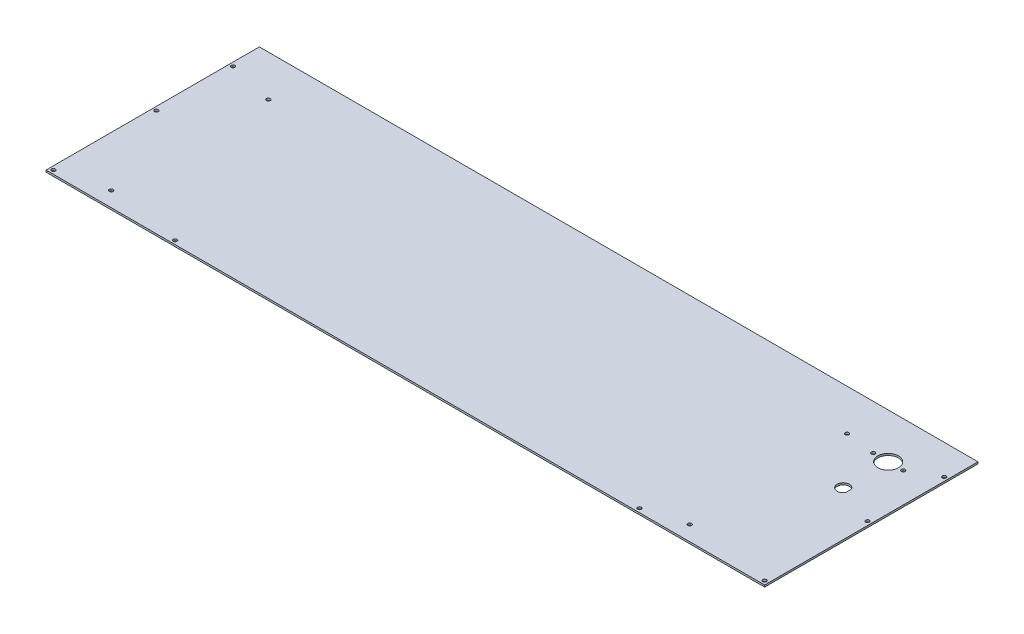
ISO-10303-21;
HEADER;
FILE_DESCRIPTION(('STEP AP214'),'2;1');
FILE_NAME('part.step','',(''),(''),'','','');
FILE_SCHEMA(('AUTOMOTIVE_DESIGN { 1 0 10303 214 1 1 1 1 }'));
ENDSEC;
DATA;
#1=APPLICATION_CONTEXT('core data for automotive mechanical design processes');
#2=APPLICATION_PROTOCOL_DEFINITION('international standard','automotive_design',2000,#1);
#3=PRODUCT_CONTEXT('',#1,'mechanical');
#4=PRODUCT('Part','Part','',(#3));
#5=PRODUCT_RELATED_PRODUCT_CATEGORY('part','',(#4));
#6=PRODUCT_DEFINITION_FORMATION('','',#4);
#7=PRODUCT_DEFINITION_CONTEXT('part definition',#1,'design');
#8=PRODUCT_DEFINITION('design','',#6,#7);
#9=PRODUCT_DEFINITION_SHAPE('','',#8);
#10=(LENGTH_UNIT() NAMED_UNIT(*) SI_UNIT(.MILLI.,.METRE.));
#11=(NAMED_UNIT(*) PLANE_ANGLE_UNIT() SI_UNIT($,.RADIAN.));
#12=(NAMED_UNIT(*) SI_UNIT($,.STERADIAN.) SOLID_ANGLE_UNIT());
#13=UNCERTAINTY_MEASURE_WITH_UNIT(LENGTH_MEASURE(1.E-05),#10,'distance_accuracy_value','');
#14=(GEOMETRIC_REPRESENTATION_CONTEXT(3) GLOBAL_UNCERTAINTY_ASSIGNED_CONTEXT((#13)) GLOBAL_UNIT_ASSIGNED_CONTEXT((#10,
#11,#12)) REPRESENTATION_CONTEXT('',''));
#15=CARTESIAN_POINT('',(0.,0.,0.));
#16=DIRECTION('',(0.,0.,1.));
#17=DIRECTION('',(1.,0.,0.));
#18=AXIS2_PLACEMENT_3D('',#15,#16,#17);
#19=CARTESIAN_POINT('',(-608.0125,358.775,1631.95));
#20=DIRECTION('',(0.,1.,0.));
#21=DIRECTION('',(-1.,0.,0.));
#22=AXIS2_PLACEMENT_3D('',#19,#20,#21);
#23=PLANE('',#22);
#24=CARTESIAN_POINT('',(-152.4,358.775,1787.525));
#25=DIRECTION('',(0.,-1.,0.));
#26=DIRECTION('',(1.,0.,0.));
#27=AXIS2_PLACEMENT_3D('',#24,#25,#26);
#28=CIRCLE('',#27,3.175);
#29=CARTESIAN_POINT('',(-149.225,358.775,1787.525));
#30=VERTEX_POINT('',#29);
#31=EDGE_CURVE('E143',#30,#30,#28,.T.);
#32=ORIENTED_EDGE('',*,*,#31,.T.);
#33=EDGE_LOOP('',(#32));
#34=FACE_BOUND('',#33,.T.);
#35=CARTESIAN_POINT('',(-1212.85,358.775,1806.575));
#36=DIRECTION('',(0.,-1.,0.));
#37=DIRECTION('',(1.,0.,0.));
#38=AXIS2_PLACEMENT_3D('',#35,#36,#37);
#39=CIRCLE('',#38,3.175);
#40=CARTESIAN_POINT('',(-1209.675,358.775,1806.575));
#41=VERTEX_POINT('',#40);
#42=EDGE_CURVE('E182',#41,#41,#39,.T.);
#43=ORIENTED_EDGE('',*,*,#42,.T.);
#44=EDGE_LOOP('',(#43));
#45=FACE_BOUND('',#44,.T.);
#46=CARTESIAN_POINT('',(-1006.475,358.775,1806.575));
#47=DIRECTION('',(0.,-1.,0.));
#48=DIRECTION('',(1.,0.,0.));
#49=AXIS2_PLACEMENT_3D('',#46,#47,#48);
#50=CIRCLE('',#49,3.175);
#51=CARTESIAN_POINT('',(-1003.3,358.775,1806.575));
#52=VERTEX_POINT('',#51);
#53=EDGE_CURVE('E177',#52,#52,#50,.T.);
#54=ORIENTED_EDGE('',*,*,#53,.T.);
#55=EDGE_LOOP('',(#54));
#56=FACE_BOUND('',#55,.T.);
#57=CARTESIAN_POINT('',(-219.075,358.775,1806.575));
#58=DIRECTION('',(0.,-1.,0.));
#59=DIRECTION('',(1.,0.,0.));
#60=AXIS2_PLACEMENT_3D('',#57,#58,#59);
#61=CIRCLE('',#60,3.175);
#62=CARTESIAN_POINT('',(-215.9,358.775,1806.575));
#63=VERTEX_POINT('',#62);
#64=EDGE_CURVE('E168',#63,#63,#61,.T.);
#65=ORIENTED_EDGE('',*,*,#64,.T.);
#66=EDGE_LOOP('',(#65));
#67=FACE_BOUND('',#66,.T.);
#68=DIRECTION('',(0.,0.,1.));
#69=VECTOR('',#68,1.);
#70=CARTESIAN_POINT('',(-4.43505971811969E-13,358.775,1631.95));
#71=LINE('',#70,#69);
#72=CARTESIAN_POINT('',(-4.43943400340539E-13,358.775,1812.925));
#73=VERTEX_POINT('',#72);
#74=CARTESIAN_POINT('',(-4.43797590831016E-13,358.775,1450.975));
#75=VERTEX_POINT('',#74);
#76=EDGE_CURVE('E72',#73,#75,#71,.F.);
#77=ORIENTED_EDGE('',*,*,#76,.T.);
#78=DIRECTION('',(1.,0.,0.));
#79=VECTOR('',#78,1.);
#80=CARTESIAN_POINT('',(-456.940621137619,358.775,1450.975));
#81=LINE('',#80,#79);
#82=CARTESIAN_POINT('',(-1219.2,358.775,1450.975));
#83=VERTEX_POINT('',#82);
#84=EDGE_CURVE('E469',#75,#83,#81,.F.);
#85=ORIENTED_EDGE('',*,*,#84,.T.);
#86=DIRECTION('',(0.,0.,1.));
#87=VECTOR('',#86,1.);
#88=CARTESIAN_POINT('',(-1219.2,358.775,1631.95));
#89=LINE('',#88,#87);
#90=CARTESIAN_POINT('',(-1219.2,358.775,1812.925));
#91=VERTEX_POINT('',#90);
#92=EDGE_CURVE('E75',#83,#91,#89,.T.);
#93=ORIENTED_EDGE('',*,*,#92,.T.);
#94=DIRECTION('',(-1.,0.,0.));
#95=VECTOR('',#94,1.);
#96=CARTESIAN_POINT('',(-609.6,358.775,1812.925));
#97=LINE('',#96,#95);
#98=EDGE_CURVE('E59',#91,#73,#97,.F.);
#99=ORIENTED_EDGE('',*,*,#98,.T.);
#100=EDGE_LOOP('',(#77,#85,#93,#99));
#101=FACE_BOUND('',#100,.T.);
#102=CARTESIAN_POINT('',(-6.35000000000045,358.775,1806.575));
#103=DIRECTION('',(0.,-1.,0.));
#104=DIRECTION('',(1.,0.,0.));
#105=AXIS2_PLACEMENT_3D('',#102,#103,#104);
#106=CIRCLE('',#105,3.175);
#107=CARTESIAN_POINT('',(-3.17500000000045,358.775,1806.575));
#108=VERTEX_POINT('',#107);
#109=EDGE_CURVE('E171',#108,#108,#106,.T.);
#110=ORIENTED_EDGE('',*,*,#109,.T.);
#111=EDGE_LOOP('',(#110));
#112=FACE_BOUND('',#111,.T.);
#113=CARTESIAN_POINT('',(-1212.85,358.775,1501.83991037368));
#114=DIRECTION('',(0.,-1.,0.));
#115=DIRECTION('',(1.,0.,0.));
#116=AXIS2_PLACEMENT_3D('',#113,#114,#115);
#117=CIRCLE('',#116,3.175);
#118=CARTESIAN_POINT('',(-1209.675,358.775,1501.83991037368));
#119=VERTEX_POINT('',#118);
#120=EDGE_CURVE('E77',#119,#119,#117,.T.);
#121=ORIENTED_EDGE('',*,*,#120,.T.);
#122=EDGE_LOOP('',(#121));
#123=FACE_BOUND('',#122,.T.);
#124=CARTESIAN_POINT('',(-1212.85,358.775,1631.95));
#125=DIRECTION('',(0.,-1.,0.));
#126=DIRECTION('',(1.,0.,0.));
#127=AXIS2_PLACEMENT_3D('',#124,#125,#126);
#128=CIRCLE('',#127,3.175);
#129=CARTESIAN_POINT('',(-1209.675,358.775,1631.95));
#130=VERTEX_POINT('',#129);
#131=EDGE_CURVE('E180',#130,#130,#128,.T.);
#132=ORIENTED_EDGE('',*,*,#131,.T.);
#133=EDGE_LOOP('',(#132));
#134=FACE_BOUND('',#133,.T.);
#135=CARTESIAN_POINT('',(-6.35000000000045,358.775,1501.83991037368));
#136=DIRECTION('',(0.,-1.,0.));
#137=DIRECTION('',(1.,0.,0.));
#138=AXIS2_PLACEMENT_3D('',#135,#136,#137);
#139=CIRCLE('',#138,3.175);
#140=CARTESIAN_POINT('',(-3.17500000000045,358.775,1501.83991037368));
#141=VERTEX_POINT('',#140);
#142=EDGE_CURVE('E165',#141,#141,#139,.T.);
#143=ORIENTED_EDGE('',*,*,#142,.T.);
#144=EDGE_LOOP('',(#143));
#145=FACE_BOUND('',#144,.T.);
#146=CARTESIAN_POINT('',(-6.35000000000045,358.775,1631.95));
#147=DIRECTION('',(0.,-1.,0.));
#148=DIRECTION('',(1.,0.,0.));
#149=AXIS2_PLACEMENT_3D('',#146,#147,#148);
#150=CIRCLE('',#149,3.175);
#151=CARTESIAN_POINT('',(-3.17500000000045,358.775,1631.95));
#152=VERTEX_POINT('',#151);
#153=EDGE_CURVE('E162',#152,#152,#150,.T.);
#154=ORIENTED_EDGE('',*,*,#153,.T.);
#155=EDGE_LOOP('',(#154));
#156=FACE_BOUND('',#155,.T.);
#157=CARTESIAN_POINT('',(-76.2,358.775,1603.375));
#158=DIRECTION('',(0.,-1.,0.));
#159=DIRECTION('',(1.,0.,0.));
#160=AXIS2_PLACEMENT_3D('',#157,#158,#159);
#161=CIRCLE('',#160,10.4013);
#162=CARTESIAN_POINT('',(-67.1957,358.775,1608.58169023469));
#163=VERTEX_POINT('',#162);
#164=CARTESIAN_POINT('',(-67.1957,358.775,1598.16830976531));
#165=VERTEX_POINT('',#164);
#166=EDGE_CURVE('E44',#163,#165,#161,.T.);
#167=ORIENTED_EDGE('',*,*,#166,.T.);
#168=DIRECTION('',(0.,0.,1.));
#169=VECTOR('',#168,1.);
#170=CARTESIAN_POINT('',(-67.1957,358.775,1603.375));
#171=LINE('',#170,#169);
#172=EDGE_CURVE('E94',#165,#163,#171,.T.);
#173=ORIENTED_EDGE('',*,*,#172,.T.);
#174=EDGE_LOOP('',(#167,#173));
#175=FACE_BOUND('',#174,.T.);
#176=CARTESIAN_POINT('',(-50.8,358.775,1527.175));
#177=DIRECTION('',(0.,-1.,0.));
#178=DIRECTION('',(1.,0.,0.));
#179=AXIS2_PLACEMENT_3D('',#176,#177,#178);
#180=CIRCLE('',#179,3.175);
#181=CARTESIAN_POINT('',(-47.625,358.775,1527.175));
#182=VERTEX_POINT('',#181);
#183=EDGE_CURVE('E159',#182,#182,#180,.T.);
#184=ORIENTED_EDGE('',*,*,#183,.T.);
#185=EDGE_LOOP('',(#184));
#186=FACE_BOUND('',#185,.T.);
#187=CARTESIAN_POINT('',(-101.6,358.775,1527.175));
#188=DIRECTION('',(0.,-1.,0.));
#189=DIRECTION('',(1.,0.,0.));
#190=AXIS2_PLACEMENT_3D('',#187,#188,#189);
#191=CIRCLE('',#190,3.175);
#192=CARTESIAN_POINT('',(-98.425,358.775,1527.175));
#193=VERTEX_POINT('',#192);
#194=EDGE_CURVE('E156',#193,#193,#191,.T.);
#195=ORIENTED_EDGE('',*,*,#194,.T.);
#196=EDGE_LOOP('',(#195));
#197=FACE_BOUND('',#196,.T.);
#198=CARTESIAN_POINT('',(-76.2,358.775,1527.175));
#199=DIRECTION('',(0.,-1.,0.));
#200=DIRECTION('',(1.,0.,0.));
#201=AXIS2_PLACEMENT_3D('',#198,#199,#200);
#202=CIRCLE('',#201,17.4625);
#203=CARTESIAN_POINT('',(-58.7375,358.775,1527.175));
#204=VERTEX_POINT('',#203);
#205=EDGE_CURVE('E153',#204,#204,#202,.T.);
#206=ORIENTED_EDGE('',*,*,#205,.T.);
#207=EDGE_LOOP('',(#206));
#208=FACE_BOUND('',#207,.T.);
#209=CARTESIAN_POINT('',(-1134.07436532974,358.775,1787.525));
#210=DIRECTION('',(0.,-1.,0.));
#211=DIRECTION('',(1.,0.,0.));
#212=AXIS2_PLACEMENT_3D('',#209,#210,#211);
#213=CIRCLE('',#212,3.175);
#214=CARTESIAN_POINT('',(-1130.89936532974,358.775,1787.525));
#215=VERTEX_POINT('',#214);
#216=EDGE_CURVE('E149',#215,#215,#213,.T.);
#217=ORIENTED_EDGE('',*,*,#216,.T.);
#218=EDGE_LOOP('',(#217));
#219=FACE_BOUND('',#218,.T.);
#220=CARTESIAN_POINT('',(-152.4,358.775,1520.825));
#221=DIRECTION('',(0.,-1.,0.));
#222=DIRECTION('',(1.,0.,0.));
#223=AXIS2_PLACEMENT_3D('',#220,#221,#222);
#224=CIRCLE('',#223,3.175);
#225=CARTESIAN_POINT('',(-149.225,358.775,1520.825));
#226=VERTEX_POINT('',#225);
#227=EDGE_CURVE('E146',#226,#226,#224,.T.);
#228=ORIENTED_EDGE('',*,*,#227,.T.);
#229=EDGE_LOOP('',(#228));
#230=FACE_BOUND('',#229,.T.);
#231=CARTESIAN_POINT('',(-1134.07436532974,358.775,1520.825));
#232=DIRECTION('',(0.,-1.,0.));
#233=DIRECTION('',(1.,0.,0.));
#234=AXIS2_PLACEMENT_3D('',#231,#232,#233);
#235=CIRCLE('',#234,3.175);
#236=CARTESIAN_POINT('',(-1130.89936532974,358.775,1520.825));
#237=VERTEX_POINT('',#236);
#238=EDGE_CURVE('E17',#237,#237,#235,.T.);
#239=ORIENTED_EDGE('',*,*,#238,.T.);
#240=EDGE_LOOP('',(#239));
#241=FACE_BOUND('',#240,.T.);
#242=ADVANCED_FACE('F14',(#34,#45,#56,#67,#101,#112,#123,#134,#145,#156,#175,#186,#197,#208,
#219,#230,#241),#23,.T.);
#243=CARTESIAN_POINT('',(-1134.07436532974,333.375,1520.825));
#244=DIRECTION('',(0.,-1.,0.));
#245=DIRECTION('',(1.,0.,0.));
#246=AXIS2_PLACEMENT_3D('',#243,#244,#245);
#247=CYLINDRICAL_SURFACE('',#246,3.175);
#248=CARTESIAN_POINT('',(-1134.07436532974,355.6,1520.825));
#249=DIRECTION('',(0.,-1.,0.));
#250=DIRECTION('',(1.,0.,0.));
#251=AXIS2_PLACEMENT_3D('',#248,#249,#250);
#252=CIRCLE('',#251,3.175);
#253=CARTESIAN_POINT('',(-1130.89936532974,355.6,1520.825));
#254=VERTEX_POINT('',#253);
#255=EDGE_CURVE('E140',#254,#254,#252,.T.);
#256=ORIENTED_EDGE('',*,*,#255,.T.);
#257=EDGE_LOOP('',(#256));
#258=FACE_BOUND('',#257,.T.);
#259=ORIENTED_EDGE('',*,*,#238,.F.);
#260=EDGE_LOOP('',(#259));
#261=FACE_BOUND('',#260,.T.);
#262=ADVANCED_FACE('F190',(#258,#261),#247,.F.);
#263=CARTESIAN_POINT('',(-1212.85,352.425,1806.575));
#264=DIRECTION('',(0.,-1.,0.));
#265=DIRECTION('',(1.,0.,0.));
#266=AXIS2_PLACEMENT_3D('',#263,#264,#265);
#267=CYLINDRICAL_SURFACE('',#266,3.175);
#268=CARTESIAN_POINT('',(-1212.85,355.6,1806.575));
#269=DIRECTION('',(0.,-1.,0.));
#270=DIRECTION('',(1.,0.,0.));
#271=AXIS2_PLACEMENT_3D('',#268,#269,#270);
#272=CIRCLE('',#271,3.175);
#273=CARTESIAN_POINT('',(-1209.675,355.6,1806.575));
#274=VERTEX_POINT('',#273);
#275=EDGE_CURVE('E137',#274,#274,#272,.T.);
#276=ORIENTED_EDGE('',*,*,#275,.T.);
#277=EDGE_LOOP('',(#276));
#278=FACE_BOUND('',#277,.T.);
#279=ORIENTED_EDGE('',*,*,#42,.F.);
#280=EDGE_LOOP('',(#279));
#281=FACE_BOUND('',#280,.T.);
#282=ADVANCED_FACE('F192',(#278,#281),#267,.F.);
#283=CARTESIAN_POINT('',(-1212.85,352.425,1631.95));
#284=DIRECTION('',(0.,-1.,0.));
#285=DIRECTION('',(1.,0.,0.));
#286=AXIS2_PLACEMENT_3D('',#283,#284,#285);
#287=CYLINDRICAL_SURFACE('',#286,3.175);
#288=CARTESIAN_POINT('',(-1212.85,355.6,1631.95));
#289=DIRECTION('',(0.,-1.,0.));
#290=DIRECTION('',(1.,0.,0.));
#291=AXIS2_PLACEMENT_3D('',#288,#289,#290);
#292=CIRCLE('',#291,3.175);
#293=CARTESIAN_POINT('',(-1209.675,355.6,1631.95));
#294=VERTEX_POINT('',#293);
#295=EDGE_CURVE('E134',#294,#294,#292,.T.);
#296=ORIENTED_EDGE('',*,*,#295,.T.);
#297=EDGE_LOOP('',(#296));
#298=FACE_BOUND('',#297,.T.);
#299=ORIENTED_EDGE('',*,*,#131,.F.);
#300=EDGE_LOOP('',(#299));
#301=FACE_BOUND('',#300,.T.);
#302=ADVANCED_FACE('F199',(#298,#301),#287,.F.);
#303=CARTESIAN_POINT('',(-1006.475,352.425,1806.575));
#304=DIRECTION('',(0.,-1.,0.));
#305=DIRECTION('',(1.,0.,0.));
#306=AXIS2_PLACEMENT_3D('',#303,#304,#305);
#307=CYLINDRICAL_SURFACE('',#306,3.175);
#308=CARTESIAN_POINT('',(-1006.475,355.6,1806.575));
#309=DIRECTION('',(0.,-1.,0.));
#310=DIRECTION('',(1.,0.,0.));
#311=AXIS2_PLACEMENT_3D('',#308,#309,#310);
#312=CIRCLE('',#311,3.175);
#313=CARTESIAN_POINT('',(-1003.3,355.6,1806.575));
#314=VERTEX_POINT('',#313);
#315=EDGE_CURVE('E131',#314,#314,#312,.T.);
#316=ORIENTED_EDGE('',*,*,#315,.T.);
#317=EDGE_LOOP('',(#316));
#318=FACE_BOUND('',#317,.T.);
#319=ORIENTED_EDGE('',*,*,#53,.F.);
#320=EDGE_LOOP('',(#319));
#321=FACE_BOUND('',#320,.T.);
#322=ADVANCED_FACE('F273',(#318,#321),#307,.F.);
#323=CARTESIAN_POINT('',(-1212.85,352.425,1501.83991037368));
#324=DIRECTION('',(0.,-1.,0.));
#325=DIRECTION('',(1.,0.,0.));
#326=AXIS2_PLACEMENT_3D('',#323,#324,#325);
#327=CYLINDRICAL_SURFACE('',#326,3.175);
#328=CARTESIAN_POINT('',(-1212.85,355.6,1501.83991037368));
#329=DIRECTION('',(0.,-1.,0.));
#330=DIRECTION('',(1.,0.,0.));
#331=AXIS2_PLACEMENT_3D('',#328,#329,#330);
#332=CIRCLE('',#331,3.175);
#333=CARTESIAN_POINT('',(-1209.675,355.6,1501.83991037368));
#334=VERTEX_POINT('',#333);
#335=EDGE_CURVE('E128',#334,#334,#332,.T.);
#336=ORIENTED_EDGE('',*,*,#335,.T.);
#337=EDGE_LOOP('',(#336));
#338=FACE_BOUND('',#337,.T.);
#339=ORIENTED_EDGE('',*,*,#120,.F.);
#340=EDGE_LOOP('',(#339));
#341=FACE_BOUND('',#340,.T.);
#342=ADVANCED_FACE('F270',(#338,#341),#327,.F.);
#343=CARTESIAN_POINT('',(-609.6,358.775,1812.925));
#344=DIRECTION('',(0.,0.,-1.));
#345=DIRECTION('',(-1.,0.,0.));
#346=AXIS2_PLACEMENT_3D('',#343,#344,#345);
#347=PLANE('',#346);
#348=DIRECTION('',(0.,-1.,0.));
#349=VECTOR('',#348,1.);
#350=CARTESIAN_POINT('',(-4.43505971811969E-13,358.775,1812.925));
#351=LINE('',#350,#349);
#352=CARTESIAN_POINT('',(-4.44089209850063E-13,355.6,1812.925));
#353=VERTEX_POINT('',#352);
#354=EDGE_CURVE('E76',#353,#73,#351,.F.);
#355=ORIENTED_EDGE('',*,*,#354,.T.);
#356=ORIENTED_EDGE('',*,*,#98,.F.);
#357=DIRECTION('',(0.,1.,0.));
#358=VECTOR('',#357,1.);
#359=CARTESIAN_POINT('',(-1219.2,358.775,1812.925));
#360=LINE('',#359,#358);
#361=CARTESIAN_POINT('',(-1219.2,355.6,1812.925));
#362=VERTEX_POINT('',#361);
#363=EDGE_CURVE('E174',#91,#362,#360,.F.);
#364=ORIENTED_EDGE('',*,*,#363,.T.);
#365=DIRECTION('',(-1.,0.,0.));
#366=VECTOR('',#365,1.);
#367=CARTESIAN_POINT('',(-608.0125,355.6,1812.925));
#368=LINE('',#367,#366);
#369=EDGE_CURVE('E90',#362,#353,#368,.F.);
#370=ORIENTED_EDGE('',*,*,#369,.T.);
#371=EDGE_LOOP('',(#355,#356,#364,#370));
#372=FACE_BOUND('',#371,.T.);
#373=ADVANCED_FACE('F89',(#372),#347,.F.);
#374=CARTESIAN_POINT('',(-4.43505971811969E-13,358.775,1631.95));
#375=DIRECTION('',(-1.,0.,0.));
#376=DIRECTION('',(0.,-1.,0.));
#377=AXIS2_PLACEMENT_3D('',#374,#375,#376);
#378=PLANE('',#377);
#379=DIRECTION('',(0.,1.,0.));
#380=VECTOR('',#379,1.);
#381=CARTESIAN_POINT('',(-4.44089209850063E-13,358.775,1450.975));
#382=LINE('',#381,#380);
#383=CARTESIAN_POINT('',(-4.44089209850063E-13,355.6,1450.975));
#384=VERTEX_POINT('',#383);
#385=EDGE_CURVE('E86',#384,#75,#382,.T.);
#386=ORIENTED_EDGE('',*,*,#385,.T.);
#387=ORIENTED_EDGE('',*,*,#76,.F.);
#388=ORIENTED_EDGE('',*,*,#354,.F.);
#389=DIRECTION('',(0.,0.,1.));
#390=VECTOR('',#389,1.);
#391=CARTESIAN_POINT('',(-4.44089209850063E-13,355.6,1631.95));
#392=LINE('',#391,#390);
#393=EDGE_CURVE('E482',#353,#384,#392,.F.);
#394=ORIENTED_EDGE('',*,*,#393,.T.);
#395=EDGE_LOOP('',(#386,#387,#388,#394));
#396=FACE_BOUND('',#395,.T.);
#397=ADVANCED_FACE('F82',(#396),#378,.F.);
#398=CARTESIAN_POINT('',(-456.940621137619,358.775,1450.975));
#399=DIRECTION('',(0.,0.,1.));
#400=DIRECTION('',(1.,0.,0.));
#401=AXIS2_PLACEMENT_3D('',#398,#399,#400);
#402=PLANE('',#401);
#403=DIRECTION('',(0.,1.,0.));
#404=VECTOR('',#403,1.);
#405=CARTESIAN_POINT('',(-1219.2,358.775,1450.975));
#406=LINE('',#405,#404);
#407=CARTESIAN_POINT('',(-1219.2,355.6,1450.975));
#408=VERTEX_POINT('',#407);
#409=EDGE_CURVE('E468',#408,#83,#406,.T.);
#410=ORIENTED_EDGE('',*,*,#409,.T.);
#411=ORIENTED_EDGE('',*,*,#84,.F.);
#412=ORIENTED_EDGE('',*,*,#385,.F.);
#413=DIRECTION('',(-1.,0.,0.));
#414=VECTOR('',#413,1.);
#415=CARTESIAN_POINT('',(-608.0125,355.6,1450.975));
#416=LINE('',#415,#414);
#417=EDGE_CURVE('E471',#384,#408,#416,.T.);
#418=ORIENTED_EDGE('',*,*,#417,.T.);
#419=EDGE_LOOP('',(#410,#411,#412,#418));
#420=FACE_BOUND('',#419,.T.);
#421=ADVANCED_FACE('F261',(#420),#402,.F.);
#422=CARTESIAN_POINT('',(-1219.2,358.775,1631.95));
#423=DIRECTION('',(1.,0.,0.));
#424=DIRECTION('',(0.,1.,0.));
#425=AXIS2_PLACEMENT_3D('',#422,#423,#424);
#426=PLANE('',#425);
#427=ORIENTED_EDGE('',*,*,#363,.F.);
#428=ORIENTED_EDGE('',*,*,#92,.F.);
#429=ORIENTED_EDGE('',*,*,#409,.F.);
#430=DIRECTION('',(0.,0.,1.));
#431=VECTOR('',#430,1.);
#432=CARTESIAN_POINT('',(-1219.2,355.6,1631.95));
#433=LINE('',#432,#431);
#434=EDGE_CURVE('E127',#408,#362,#433,.T.);
#435=ORIENTED_EDGE('',*,*,#434,.T.);
#436=EDGE_LOOP('',(#427,#428,#429,#435));
#437=FACE_BOUND('',#436,.T.);
#438=ADVANCED_FACE('F257',(#437),#426,.F.);
#439=CARTESIAN_POINT('',(-6.35000000000045,352.425,1806.575));
#440=DIRECTION('',(0.,-1.,0.));
#441=DIRECTION('',(1.,0.,0.));
#442=AXIS2_PLACEMENT_3D('',#439,#440,#441);
#443=CYLINDRICAL_SURFACE('',#442,3.175);
#444=CARTESIAN_POINT('',(-6.35000000000045,355.6,1806.575));
#445=DIRECTION('',(0.,-1.,0.));
#446=DIRECTION('',(1.,0.,0.));
#447=AXIS2_PLACEMENT_3D('',#444,#445,#446);
#448=CIRCLE('',#447,3.175);
#449=CARTESIAN_POINT('',(-3.17500000000045,355.6,1806.575));
#450=VERTEX_POINT('',#449);
#451=EDGE_CURVE('E124',#450,#450,#448,.T.);
#452=ORIENTED_EDGE('',*,*,#451,.T.);
#453=EDGE_LOOP('',(#452));
#454=FACE_BOUND('',#453,.T.);
#455=ORIENTED_EDGE('',*,*,#109,.F.);
#456=EDGE_LOOP('',(#455));
#457=FACE_BOUND('',#456,.T.);
#458=ADVANCED_FACE('F253',(#454,#457),#443,.F.);
#459=CARTESIAN_POINT('',(-219.075,352.425,1806.575));
#460=DIRECTION('',(0.,-1.,0.));
#461=DIRECTION('',(1.,0.,0.));
#462=AXIS2_PLACEMENT_3D('',#459,#460,#461);
#463=CYLINDRICAL_SURFACE('',#462,3.175);
#464=CARTESIAN_POINT('',(-219.075,355.6,1806.575));
#465=DIRECTION('',(0.,-1.,0.));
#466=DIRECTION('',(1.,0.,0.));
#467=AXIS2_PLACEMENT_3D('',#464,#465,#466);
#468=CIRCLE('',#467,3.175);
#469=CARTESIAN_POINT('',(-215.9,355.6,1806.575));
#470=VERTEX_POINT('',#469);
#471=EDGE_CURVE('E121',#470,#470,#468,.T.);
#472=ORIENTED_EDGE('',*,*,#471,.T.);
#473=EDGE_LOOP('',(#472));
#474=FACE_BOUND('',#473,.T.);
#475=ORIENTED_EDGE('',*,*,#64,.F.);
#476=EDGE_LOOP('',(#475));
#477=FACE_BOUND('',#476,.T.);
#478=ADVANCED_FACE('F249',(#474,#477),#463,.F.);
#479=CARTESIAN_POINT('',(-6.35000000000045,352.425,1501.83991037368));
#480=DIRECTION('',(0.,-1.,0.));
#481=DIRECTION('',(1.,0.,0.));
#482=AXIS2_PLACEMENT_3D('',#479,#480,#481);
#483=CYLINDRICAL_SURFACE('',#482,3.175);
#484=CARTESIAN_POINT('',(-6.35000000000045,355.6,1501.83991037368));
#485=DIRECTION('',(0.,-1.,0.));
#486=DIRECTION('',(1.,0.,0.));
#487=AXIS2_PLACEMENT_3D('',#484,#485,#486);
#488=CIRCLE('',#487,3.175);
#489=CARTESIAN_POINT('',(-3.17500000000045,355.6,1501.83991037368));
#490=VERTEX_POINT('',#489);
#491=EDGE_CURVE('E118',#490,#490,#488,.T.);
#492=ORIENTED_EDGE('',*,*,#491,.T.);
#493=EDGE_LOOP('',(#492));
#494=FACE_BOUND('',#493,.T.);
#495=ORIENTED_EDGE('',*,*,#142,.F.);
#496=EDGE_LOOP('',(#495));
#497=FACE_BOUND('',#496,.T.);
#498=ADVANCED_FACE('F245',(#494,#497),#483,.F.);
#499=CARTESIAN_POINT('',(-6.35000000000045,352.425,1631.95));
#500=DIRECTION('',(0.,-1.,0.));
#501=DIRECTION('',(1.,0.,0.));
#502=AXIS2_PLACEMENT_3D('',#499,#500,#501);
#503=CYLINDRICAL_SURFACE('',#502,3.175);
#504=CARTESIAN_POINT('',(-6.35000000000045,355.6,1631.95));
#505=DIRECTION('',(0.,-1.,0.));
#506=DIRECTION('',(1.,0.,0.));
#507=AXIS2_PLACEMENT_3D('',#504,#505,#506);
#508=CIRCLE('',#507,3.175);
#509=CARTESIAN_POINT('',(-3.17500000000045,355.6,1631.95));
#510=VERTEX_POINT('',#509);
#511=EDGE_CURVE('E115',#510,#510,#508,.T.);
#512=ORIENTED_EDGE('',*,*,#511,.T.);
#513=EDGE_LOOP('',(#512));
#514=FACE_BOUND('',#513,.T.);
#515=ORIENTED_EDGE('',*,*,#153,.F.);
#516=EDGE_LOOP('',(#515));
#517=FACE_BOUND('',#516,.T.);
#518=ADVANCED_FACE('F241',(#514,#517),#503,.F.);
#519=CARTESIAN_POINT('',(-50.8,333.375,1527.175));
#520=DIRECTION('',(0.,-1.,0.));
#521=DIRECTION('',(1.,0.,0.));
#522=AXIS2_PLACEMENT_3D('',#519,#520,#521);
#523=CYLINDRICAL_SURFACE('',#522,3.175);
#524=CARTESIAN_POINT('',(-50.8,355.6,1527.175));
#525=DIRECTION('',(0.,-1.,0.));
#526=DIRECTION('',(1.,0.,0.));
#527=AXIS2_PLACEMENT_3D('',#524,#525,#526);
#528=CIRCLE('',#527,3.175);
#529=CARTESIAN_POINT('',(-47.625,355.6,1527.175));
#530=VERTEX_POINT('',#529);
#531=EDGE_CURVE('E112',#530,#530,#528,.T.);
#532=ORIENTED_EDGE('',*,*,#531,.T.);
#533=EDGE_LOOP('',(#532));
#534=FACE_BOUND('',#533,.T.);
#535=ORIENTED_EDGE('',*,*,#183,.F.);
#536=EDGE_LOOP('',(#535));
#537=FACE_BOUND('',#536,.T.);
#538=ADVANCED_FACE('F237',(#534,#537),#523,.F.);
#539=CARTESIAN_POINT('',(-101.6,333.375,1527.175));
#540=DIRECTION('',(0.,-1.,0.));
#541=DIRECTION('',(1.,0.,0.));
#542=AXIS2_PLACEMENT_3D('',#539,#540,#541);
#543=CYLINDRICAL_SURFACE('',#542,3.175);
#544=CARTESIAN_POINT('',(-101.6,355.6,1527.175));
#545=DIRECTION('',(0.,-1.,0.));
#546=DIRECTION('',(1.,0.,0.));
#547=AXIS2_PLACEMENT_3D('',#544,#545,#546);
#548=CIRCLE('',#547,3.175);
#549=CARTESIAN_POINT('',(-98.425,355.6,1527.175));
#550=VERTEX_POINT('',#549);
#551=EDGE_CURVE('E109',#550,#550,#548,.T.);
#552=ORIENTED_EDGE('',*,*,#551,.T.);
#553=EDGE_LOOP('',(#552));
#554=FACE_BOUND('',#553,.T.);
#555=ORIENTED_EDGE('',*,*,#194,.F.);
#556=EDGE_LOOP('',(#555));
#557=FACE_BOUND('',#556,.T.);
#558=ADVANCED_FACE('F233',(#554,#557),#543,.F.);
#559=CARTESIAN_POINT('',(-76.2,333.375,1527.175));
#560=DIRECTION('',(0.,-1.,0.));
#561=DIRECTION('',(1.,0.,0.));
#562=AXIS2_PLACEMENT_3D('',#559,#560,#561);
#563=CYLINDRICAL_SURFACE('',#562,17.4625);
#564=CARTESIAN_POINT('',(-76.2,355.6,1527.175));
#565=DIRECTION('',(0.,-1.,0.));
#566=DIRECTION('',(1.,0.,0.));
#567=AXIS2_PLACEMENT_3D('',#564,#565,#566);
#568=CIRCLE('',#567,17.4625);
#569=CARTESIAN_POINT('',(-58.7375,355.6,1527.175));
#570=VERTEX_POINT('',#569);
#571=EDGE_CURVE('E106',#570,#570,#568,.T.);
#572=ORIENTED_EDGE('',*,*,#571,.T.);
#573=EDGE_LOOP('',(#572));
#574=FACE_BOUND('',#573,.T.);
#575=ORIENTED_EDGE('',*,*,#205,.F.);
#576=EDGE_LOOP('',(#575));
#577=FACE_BOUND('',#576,.T.);
#578=ADVANCED_FACE('F230',(#574,#577),#563,.F.);
#579=CARTESIAN_POINT('',(-76.2,333.375,1603.375));
#580=DIRECTION('',(0.,-1.,0.));
#581=DIRECTION('',(1.,0.,0.));
#582=AXIS2_PLACEMENT_3D('',#579,#580,#581);
#583=CYLINDRICAL_SURFACE('',#582,10.4013);
#584=ORIENTED_EDGE('',*,*,#166,.F.);
#585=DIRECTION('',(0.,1.,0.));
#586=VECTOR('',#585,1.);
#587=CARTESIAN_POINT('',(-67.1957,333.375,1608.58169023469));
#588=LINE('',#587,#586);
#589=CARTESIAN_POINT('',(-67.1957,355.6,1608.58169023469));
#590=VERTEX_POINT('',#589);
#591=EDGE_CURVE('E95',#163,#590,#588,.F.);
#592=ORIENTED_EDGE('',*,*,#591,.T.);
#593=CARTESIAN_POINT('',(-76.2,355.6,1603.375));
#594=DIRECTION('',(0.,-1.,0.));
#595=DIRECTION('',(1.,0.,0.));
#596=AXIS2_PLACEMENT_3D('',#593,#594,#595);
#597=CIRCLE('',#596,10.4013);
#598=CARTESIAN_POINT('',(-67.1957,355.6,1598.16830976531));
#599=VERTEX_POINT('',#598);
#600=EDGE_CURVE('E103',#590,#599,#597,.T.);
#601=ORIENTED_EDGE('',*,*,#600,.T.);
#602=DIRECTION('',(0.,1.,0.));
#603=VECTOR('',#602,1.);
#604=CARTESIAN_POINT('',(-67.1957,333.375,1598.16830976531));
#605=LINE('',#604,#603);
#606=EDGE_CURVE('E32',#599,#165,#605,.T.);
#607=ORIENTED_EDGE('',*,*,#606,.T.);
#608=EDGE_LOOP('',(#584,#592,#601,#607));
#609=FACE_BOUND('',#608,.T.);
#610=ADVANCED_FACE('F227',(#609),#583,.F.);
#611=CARTESIAN_POINT('',(-67.1957,333.375,1603.375));
#612=DIRECTION('',(1.,0.,0.));
#613=DIRECTION('',(0.,1.,0.));
#614=AXIS2_PLACEMENT_3D('',#611,#612,#613);
#615=PLANE('',#614);
#616=ORIENTED_EDGE('',*,*,#172,.F.);
#617=ORIENTED_EDGE('',*,*,#606,.F.);
#618=DIRECTION('',(0.,0.,1.));
#619=VECTOR('',#618,1.);
#620=CARTESIAN_POINT('',(-67.1957,355.6,1631.95));
#621=LINE('',#620,#619);
#622=EDGE_CURVE('E102',#599,#590,#621,.T.);
#623=ORIENTED_EDGE('',*,*,#622,.T.);
#624=ORIENTED_EDGE('',*,*,#591,.F.);
#625=EDGE_LOOP('',(#616,#617,#623,#624));
#626=FACE_BOUND('',#625,.T.);
#627=ADVANCED_FACE('F223',(#626),#615,.F.);
#628=CARTESIAN_POINT('',(-1134.07436532974,333.375,1787.525));
#629=DIRECTION('',(0.,-1.,0.));
#630=DIRECTION('',(1.,0.,0.));
#631=AXIS2_PLACEMENT_3D('',#628,#629,#630);
#632=CYLINDRICAL_SURFACE('',#631,3.175);
#633=CARTESIAN_POINT('',(-1134.07436532974,355.6,1787.525));
#634=DIRECTION('',(0.,-1.,0.));
#635=DIRECTION('',(1.,0.,0.));
#636=AXIS2_PLACEMENT_3D('',#633,#634,#635);
#637=CIRCLE('',#636,3.175);
#638=CARTESIAN_POINT('',(-1130.89936532974,355.6,1787.525));
#639=VERTEX_POINT('',#638);
#640=EDGE_CURVE('E99',#639,#639,#637,.T.);
#641=ORIENTED_EDGE('',*,*,#640,.T.);
#642=EDGE_LOOP('',(#641));
#643=FACE_BOUND('',#642,.T.);
#644=ORIENTED_EDGE('',*,*,#216,.F.);
#645=EDGE_LOOP('',(#644));
#646=FACE_BOUND('',#645,.T.);
#647=ADVANCED_FACE('F219',(#643,#646),#632,.F.);
#648=CARTESIAN_POINT('',(-152.4,333.375,1520.825));
#649=DIRECTION('',(0.,-1.,0.));
#650=DIRECTION('',(1.,0.,0.));
#651=AXIS2_PLACEMENT_3D('',#648,#649,#650);
#652=CYLINDRICAL_SURFACE('',#651,3.175);
#653=CARTESIAN_POINT('',(-152.4,355.6,1520.825));
#654=DIRECTION('',(0.,-1.,0.));
#655=DIRECTION('',(1.,0.,0.));
#656=AXIS2_PLACEMENT_3D('',#653,#654,#655);
#657=CIRCLE('',#656,3.175);
#658=CARTESIAN_POINT('',(-149.225,355.6,1520.825));
#659=VERTEX_POINT('',#658);
#660=EDGE_CURVE('E23',#659,#659,#657,.T.);
#661=ORIENTED_EDGE('',*,*,#660,.T.);
#662=EDGE_LOOP('',(#661));
#663=FACE_BOUND('',#662,.T.);
#664=ORIENTED_EDGE('',*,*,#227,.F.);
#665=EDGE_LOOP('',(#664));
#666=FACE_BOUND('',#665,.T.);
#667=ADVANCED_FACE('F211',(#663,#666),#652,.F.);
#668=CARTESIAN_POINT('',(-152.4,333.375,1787.525));
#669=DIRECTION('',(0.,-1.,0.));
#670=DIRECTION('',(1.,0.,0.));
#671=AXIS2_PLACEMENT_3D('',#668,#669,#670);
#672=CYLINDRICAL_SURFACE('',#671,3.175);
#673=CARTESIAN_POINT('',(-152.4,355.6,1787.525));
#674=DIRECTION('',(0.,-1.,0.));
#675=DIRECTION('',(1.,0.,0.));
#676=AXIS2_PLACEMENT_3D('',#673,#674,#675);
#677=CIRCLE('',#676,3.175);
#678=CARTESIAN_POINT('',(-149.225,355.6,1787.525));
#679=VERTEX_POINT('',#678);
#680=EDGE_CURVE('E9',#679,#679,#677,.T.);
#681=ORIENTED_EDGE('',*,*,#680,.T.);
#682=EDGE_LOOP('',(#681));
#683=FACE_BOUND('',#682,.T.);
#684=ORIENTED_EDGE('',*,*,#31,.F.);
#685=EDGE_LOOP('',(#684));
#686=FACE_BOUND('',#685,.T.);
#687=ADVANCED_FACE('F205',(#683,#686),#672,.F.);
#688=CARTESIAN_POINT('',(-608.0125,355.6,1631.95));
#689=DIRECTION('',(0.,1.,0.));
#690=DIRECTION('',(-1.,0.,0.));
#691=AXIS2_PLACEMENT_3D('',#688,#689,#690);
#692=PLANE('',#691);
#693=ORIENTED_EDGE('',*,*,#680,.F.);
#694=EDGE_LOOP('',(#693));
#695=FACE_BOUND('',#694,.T.);
#696=ORIENTED_EDGE('',*,*,#660,.F.);
#697=EDGE_LOOP('',(#696));
#698=FACE_BOUND('',#697,.T.);
#699=ORIENTED_EDGE('',*,*,#640,.F.);
#700=EDGE_LOOP('',(#699));
#701=FACE_BOUND('',#700,.T.);
#702=ORIENTED_EDGE('',*,*,#600,.F.);
#703=ORIENTED_EDGE('',*,*,#622,.F.);
#704=EDGE_LOOP('',(#702,#703));
#705=FACE_BOUND('',#704,.T.);
#706=ORIENTED_EDGE('',*,*,#571,.F.);
#707=EDGE_LOOP('',(#706));
#708=FACE_BOUND('',#707,.T.);
#709=ORIENTED_EDGE('',*,*,#551,.F.);
#710=EDGE_LOOP('',(#709));
#711=FACE_BOUND('',#710,.T.);
#712=ORIENTED_EDGE('',*,*,#531,.F.);
#713=EDGE_LOOP('',(#712));
#714=FACE_BOUND('',#713,.T.);
#715=ORIENTED_EDGE('',*,*,#511,.F.);
#716=EDGE_LOOP('',(#715));
#717=FACE_BOUND('',#716,.T.);
#718=ORIENTED_EDGE('',*,*,#491,.F.);
#719=EDGE_LOOP('',(#718));
#720=FACE_BOUND('',#719,.T.);
#721=ORIENTED_EDGE('',*,*,#471,.F.);
#722=EDGE_LOOP('',(#721));
#723=FACE_BOUND('',#722,.T.);
#724=ORIENTED_EDGE('',*,*,#451,.F.);
#725=EDGE_LOOP('',(#724));
#726=FACE_BOUND('',#725,.T.);
#727=ORIENTED_EDGE('',*,*,#417,.F.);
#728=ORIENTED_EDGE('',*,*,#393,.F.);
#729=ORIENTED_EDGE('',*,*,#369,.F.);
#730=ORIENTED_EDGE('',*,*,#434,.F.);
#731=EDGE_LOOP('',(#727,#728,#729,#730));
#732=FACE_BOUND('',#731,.T.);
#733=ORIENTED_EDGE('',*,*,#335,.F.);
#734=EDGE_LOOP('',(#733));
#735=FACE_BOUND('',#734,.T.);
#736=ORIENTED_EDGE('',*,*,#315,.F.);
#737=EDGE_LOOP('',(#736));
#738=FACE_BOUND('',#737,.T.);
#739=ORIENTED_EDGE('',*,*,#295,.F.);
#740=EDGE_LOOP('',(#739));
#741=FACE_BOUND('',#740,.T.);
#742=ORIENTED_EDGE('',*,*,#275,.F.);
#743=EDGE_LOOP('',(#742));
#744=FACE_BOUND('',#743,.T.);
#745=ORIENTED_EDGE('',*,*,#255,.F.);
#746=EDGE_LOOP('',(#745));
#747=FACE_BOUND('',#746,.T.);
#748=ADVANCED_FACE('F203',(#695,#698,#701,#705,#708,#711,#714,#717,#720,#723,#726,#732,#735,
#738,#741,#744,#747),#692,.F.);
#749=CLOSED_SHELL('',(#242,#262,#282,#302,#322,#342,#373,#397,#421,#438,#458,#478,#498,#518,
#538,#558,#578,#610,#627,#647,#667,#687,#748));
#750=MANIFOLD_SOLID_BREP('B1',#749);
#751=ADVANCED_BREP_SHAPE_REPRESENTATION('',(#18,#750),#14);
#752=SHAPE_DEFINITION_REPRESENTATION(#9,#751);
ENDSEC;
END-ISO-10303-21;
